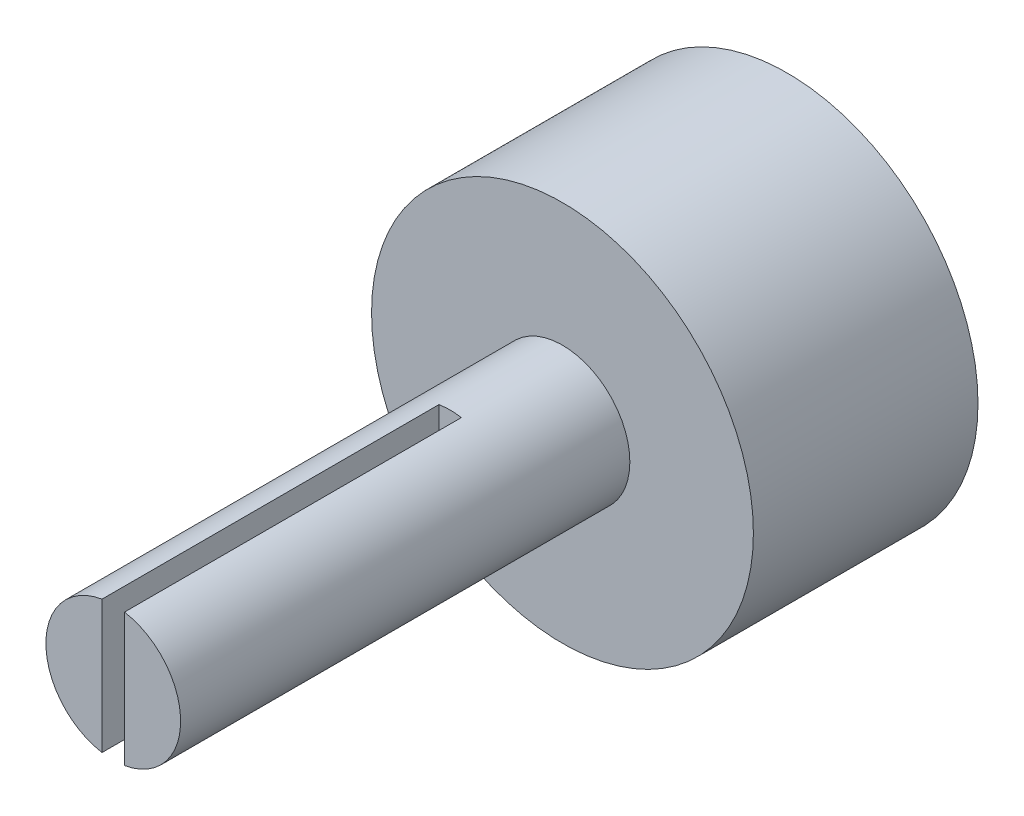
ISO-10303-21;
HEADER;
FILE_DESCRIPTION(('STEP AP214'),'2;1');
FILE_NAME('part.step','',(''),(''),'','','');
FILE_SCHEMA(('AUTOMOTIVE_DESIGN { 1 0 10303 214 1 1 1 1 }'));
ENDSEC;
DATA;
#1=APPLICATION_CONTEXT('core data for automotive mechanical design processes');
#2=APPLICATION_PROTOCOL_DEFINITION('international standard','automotive_design',2000,#1);
#3=PRODUCT_CONTEXT('',#1,'mechanical');
#4=PRODUCT('Part','Part','',(#3));
#5=PRODUCT_RELATED_PRODUCT_CATEGORY('part','',(#4));
#6=PRODUCT_DEFINITION_FORMATION('','',#4);
#7=PRODUCT_DEFINITION_CONTEXT('part definition',#1,'design');
#8=PRODUCT_DEFINITION('design','',#6,#7);
#9=PRODUCT_DEFINITION_SHAPE('','',#8);
#10=(LENGTH_UNIT() NAMED_UNIT(*) SI_UNIT(.MILLI.,.METRE.));
#11=(NAMED_UNIT(*) PLANE_ANGLE_UNIT() SI_UNIT($,.RADIAN.));
#12=(NAMED_UNIT(*) SI_UNIT($,.STERADIAN.) SOLID_ANGLE_UNIT());
#13=UNCERTAINTY_MEASURE_WITH_UNIT(LENGTH_MEASURE(1.E-05),#10,'distance_accuracy_value','');
#14=(GEOMETRIC_REPRESENTATION_CONTEXT(3) GLOBAL_UNCERTAINTY_ASSIGNED_CONTEXT((#13)) GLOBAL_UNIT_ASSIGNED_CONTEXT((#10,
#11,#12)) REPRESENTATION_CONTEXT('',''));
#15=CARTESIAN_POINT('',(0.,0.,0.));
#16=DIRECTION('',(0.,0.,1.));
#17=DIRECTION('',(1.,0.,0.));
#18=AXIS2_PLACEMENT_3D('',#15,#16,#17);
#19=CARTESIAN_POINT('',(0.,0.,20.));
#20=DIRECTION('',(0.,0.,-1.));
#21=DIRECTION('',(-1.,0.,0.));
#22=AXIS2_PLACEMENT_3D('',#19,#20,#21);
#23=CYLINDRICAL_SURFACE('',#22,3.);
#24=CARTESIAN_POINT('',(0.,0.,0.));
#25=DIRECTION('',(0.,0.,1.));
#26=DIRECTION('',(1.,0.,0.));
#27=AXIS2_PLACEMENT_3D('',#24,#25,#26);
#28=CIRCLE('',#27,3.);
#29=CARTESIAN_POINT('',(3.,0.,0.));
#30=VERTEX_POINT('',#29);
#31=EDGE_CURVE('E99',#30,#30,#28,.T.);
#32=ORIENTED_EDGE('',*,*,#31,.T.);
#33=EDGE_LOOP('',(#32));
#34=FACE_BOUND('',#33,.T.);
#35=DIRECTION('',(0.,0.,-1.));
#36=VECTOR('',#35,1.);
#37=CARTESIAN_POINT('',(0.5,2.95803989154981,20.));
#38=LINE('',#37,#36);
#39=CARTESIAN_POINT('',(0.5,2.95803989154981,20.));
#40=VERTEX_POINT('',#39);
#41=CARTESIAN_POINT('',(0.5,2.95803989154981,5.));
#42=VERTEX_POINT('',#41);
#43=EDGE_CURVE('E120',#40,#42,#38,.T.);
#44=ORIENTED_EDGE('',*,*,#43,.F.);
#45=CARTESIAN_POINT('',(0.,0.,20.));
#46=DIRECTION('',(0.,0.,1.));
#47=DIRECTION('',(1.,0.,0.));
#48=AXIS2_PLACEMENT_3D('',#45,#46,#47);
#49=CIRCLE('',#48,3.);
#50=CARTESIAN_POINT('',(0.5,-2.95803989154981,20.));
#51=VERTEX_POINT('',#50);
#52=EDGE_CURVE('E95',#51,#40,#49,.T.);
#53=ORIENTED_EDGE('',*,*,#52,.F.);
#54=DIRECTION('',(0.,0.,-1.));
#55=VECTOR('',#54,1.);
#56=CARTESIAN_POINT('',(0.5,-2.95803989154981,20.));
#57=LINE('',#56,#55);
#58=CARTESIAN_POINT('',(0.5,-2.95803989154981,5.));
#59=VERTEX_POINT('',#58);
#60=EDGE_CURVE('E119',#59,#51,#57,.F.);
#61=ORIENTED_EDGE('',*,*,#60,.F.);
#62=CARTESIAN_POINT('',(0.,0.,5.));
#63=DIRECTION('',(0.,0.,1.));
#64=DIRECTION('',(0.,-1.,0.));
#65=AXIS2_PLACEMENT_3D('',#62,#63,#64);
#66=CIRCLE('',#65,3.);
#67=CARTESIAN_POINT('',(-0.5,-2.95803989154981,5.));
#68=VERTEX_POINT('',#67);
#69=EDGE_CURVE('E42',#68,#59,#66,.T.);
#70=ORIENTED_EDGE('',*,*,#69,.F.);
#71=DIRECTION('',(0.,0.,-1.));
#72=VECTOR('',#71,1.);
#73=CARTESIAN_POINT('',(-0.5,-2.95803989154981,20.));
#74=LINE('',#73,#72);
#75=CARTESIAN_POINT('',(-0.5,-2.95803989154981,20.));
#76=VERTEX_POINT('',#75);
#77=EDGE_CURVE('E79',#68,#76,#74,.F.);
#78=ORIENTED_EDGE('',*,*,#77,.T.);
#79=CARTESIAN_POINT('',(-0.5,2.95803989154981,20.));
#80=VERTEX_POINT('',#79);
#81=EDGE_CURVE('E86',#80,#76,#49,.T.);
#82=ORIENTED_EDGE('',*,*,#81,.F.);
#83=DIRECTION('',(0.,0.,-1.));
#84=VECTOR('',#83,1.);
#85=CARTESIAN_POINT('',(-0.5,2.95803989154981,20.));
#86=LINE('',#85,#84);
#87=CARTESIAN_POINT('',(-0.5,2.95803989154981,5.));
#88=VERTEX_POINT('',#87);
#89=EDGE_CURVE('E54',#80,#88,#86,.T.);
#90=ORIENTED_EDGE('',*,*,#89,.T.);
#91=EDGE_CURVE('E11',#42,#88,#66,.T.);
#92=ORIENTED_EDGE('',*,*,#91,.F.);
#93=EDGE_LOOP('',(#44,#53,#61,#70,#78,#82,#90,#92));
#94=FACE_BOUND('',#93,.T.);
#95=ADVANCED_FACE('F39',(#34,#94),#23,.T.);
#96=CARTESIAN_POINT('',(0.,0.,20.));
#97=DIRECTION('',(0.,0.,1.));
#98=DIRECTION('',(1.,0.,0.));
#99=AXIS2_PLACEMENT_3D('',#96,#97,#98);
#100=PLANE('',#99);
#101=ORIENTED_EDGE('',*,*,#52,.T.);
#102=DIRECTION('',(0.,-1.,0.));
#103=VECTOR('',#102,1.);
#104=CARTESIAN_POINT('',(0.5,0.,20.));
#105=LINE('',#104,#103);
#106=EDGE_CURVE('E85',#40,#51,#105,.T.);
#107=ORIENTED_EDGE('',*,*,#106,.T.);
#108=EDGE_LOOP('',(#101,#107));
#109=FACE_BOUND('',#108,.T.);
#110=ADVANCED_FACE('F149',(#109),#100,.T.);
#111=DIRECTION('',(0.,-1.,0.));
#112=VECTOR('',#111,1.);
#113=CARTESIAN_POINT('',(-0.5,0.,20.));
#114=LINE('',#113,#112);
#115=EDGE_CURVE('E76',#80,#76,#114,.T.);
#116=ORIENTED_EDGE('',*,*,#115,.F.);
#117=ORIENTED_EDGE('',*,*,#81,.T.);
#118=EDGE_LOOP('',(#116,#117));
#119=FACE_BOUND('',#118,.T.);
#120=ADVANCED_FACE('F93',(#119),#100,.T.);
#121=CARTESIAN_POINT('',(0.,0.,-10.));
#122=DIRECTION('',(0.,0.,1.));
#123=DIRECTION('',(1.,0.,0.));
#124=AXIS2_PLACEMENT_3D('',#121,#122,#123);
#125=CYLINDRICAL_SURFACE('',#124,8.5);
#126=CARTESIAN_POINT('',(0.,0.,-10.));
#127=DIRECTION('',(0.,0.,1.));
#128=DIRECTION('',(1.,0.,0.));
#129=AXIS2_PLACEMENT_3D('',#126,#127,#128);
#130=CIRCLE('',#129,8.5);
#131=CARTESIAN_POINT('',(8.5,0.,-10.));
#132=VERTEX_POINT('',#131);
#133=EDGE_CURVE('E106',#132,#132,#130,.T.);
#134=ORIENTED_EDGE('',*,*,#133,.T.);
#135=EDGE_LOOP('',(#134));
#136=FACE_BOUND('',#135,.T.);
#137=CARTESIAN_POINT('',(0.,0.,0.));
#138=DIRECTION('',(0.,0.,1.));
#139=DIRECTION('',(1.,0.,0.));
#140=AXIS2_PLACEMENT_3D('',#137,#138,#139);
#141=CIRCLE('',#140,8.5);
#142=CARTESIAN_POINT('',(8.5,0.,0.));
#143=VERTEX_POINT('',#142);
#144=EDGE_CURVE('E102',#143,#143,#141,.T.);
#145=ORIENTED_EDGE('',*,*,#144,.F.);
#146=EDGE_LOOP('',(#145));
#147=FACE_BOUND('',#146,.T.);
#148=ADVANCED_FACE('F139',(#136,#147),#125,.T.);
#149=CARTESIAN_POINT('',(0.,0.,-10.));
#150=DIRECTION('',(0.,0.,1.));
#151=DIRECTION('',(1.,0.,0.));
#152=AXIS2_PLACEMENT_3D('',#149,#150,#151);
#153=PLANE('',#152);
#154=ORIENTED_EDGE('',*,*,#133,.F.);
#155=EDGE_LOOP('',(#154));
#156=FACE_BOUND('',#155,.T.);
#157=ADVANCED_FACE('F141',(#156),#153,.F.);
#158=CARTESIAN_POINT('',(0.,0.,0.));
#159=DIRECTION('',(0.,0.,1.));
#160=DIRECTION('',(1.,0.,0.));
#161=AXIS2_PLACEMENT_3D('',#158,#159,#160);
#162=PLANE('',#161);
#163=ORIENTED_EDGE('',*,*,#31,.F.);
#164=EDGE_LOOP('',(#163));
#165=FACE_BOUND('',#164,.T.);
#166=ORIENTED_EDGE('',*,*,#144,.T.);
#167=EDGE_LOOP('',(#166));
#168=FACE_BOUND('',#167,.T.);
#169=ADVANCED_FACE('F137',(#165,#168),#162,.T.);
#170=CARTESIAN_POINT('',(0.5,3.,5.));
#171=DIRECTION('',(0.,0.,1.));
#172=DIRECTION('',(0.,-1.,0.));
#173=AXIS2_PLACEMENT_3D('',#170,#171,#172);
#174=PLANE('',#173);
#175=DIRECTION('',(0.,1.,0.));
#176=VECTOR('',#175,1.);
#177=CARTESIAN_POINT('',(0.5,3.,5.));
#178=LINE('',#177,#176);
#179=EDGE_CURVE('E91',#59,#42,#178,.T.);
#180=ORIENTED_EDGE('',*,*,#179,.T.);
#181=ORIENTED_EDGE('',*,*,#91,.T.);
#182=DIRECTION('',(0.,1.,0.));
#183=VECTOR('',#182,1.);
#184=CARTESIAN_POINT('',(-0.5,3.,5.));
#185=LINE('',#184,#183);
#186=EDGE_CURVE('E116',#68,#88,#185,.T.);
#187=ORIENTED_EDGE('',*,*,#186,.F.);
#188=ORIENTED_EDGE('',*,*,#69,.T.);
#189=EDGE_LOOP('',(#180,#181,#187,#188));
#190=FACE_BOUND('',#189,.T.);
#191=ADVANCED_FACE('F115',(#190),#174,.T.);
#192=CARTESIAN_POINT('',(0.5,0.,0.));
#193=DIRECTION('',(-1.,0.,0.));
#194=DIRECTION('',(0.,0.,1.));
#195=AXIS2_PLACEMENT_3D('',#192,#193,#194);
#196=PLANE('',#195);
#197=ORIENTED_EDGE('',*,*,#43,.T.);
#198=ORIENTED_EDGE('',*,*,#179,.F.);
#199=ORIENTED_EDGE('',*,*,#60,.T.);
#200=ORIENTED_EDGE('',*,*,#106,.F.);
#201=EDGE_LOOP('',(#197,#198,#199,#200));
#202=FACE_BOUND('',#201,.T.);
#203=ADVANCED_FACE('F118',(#202),#196,.T.);
#204=CARTESIAN_POINT('',(-0.5,0.,0.));
#205=DIRECTION('',(-1.,0.,0.));
#206=DIRECTION('',(0.,0.,1.));
#207=AXIS2_PLACEMENT_3D('',#204,#205,#206);
#208=PLANE('',#207);
#209=ORIENTED_EDGE('',*,*,#115,.T.);
#210=ORIENTED_EDGE('',*,*,#77,.F.);
#211=ORIENTED_EDGE('',*,*,#186,.T.);
#212=ORIENTED_EDGE('',*,*,#89,.F.);
#213=EDGE_LOOP('',(#209,#210,#211,#212));
#214=FACE_BOUND('',#213,.T.);
#215=ADVANCED_FACE('F78',(#214),#208,.F.);
#216=CLOSED_SHELL('',(#95,#110,#120,#148,#157,#169,#191,#203,#215));
#217=MANIFOLD_SOLID_BREP('B2',#216);
#218=ADVANCED_BREP_SHAPE_REPRESENTATION('',(#18,#217),#14);
#219=SHAPE_DEFINITION_REPRESENTATION(#9,#218);
ENDSEC;
END-ISO-10303-21;
